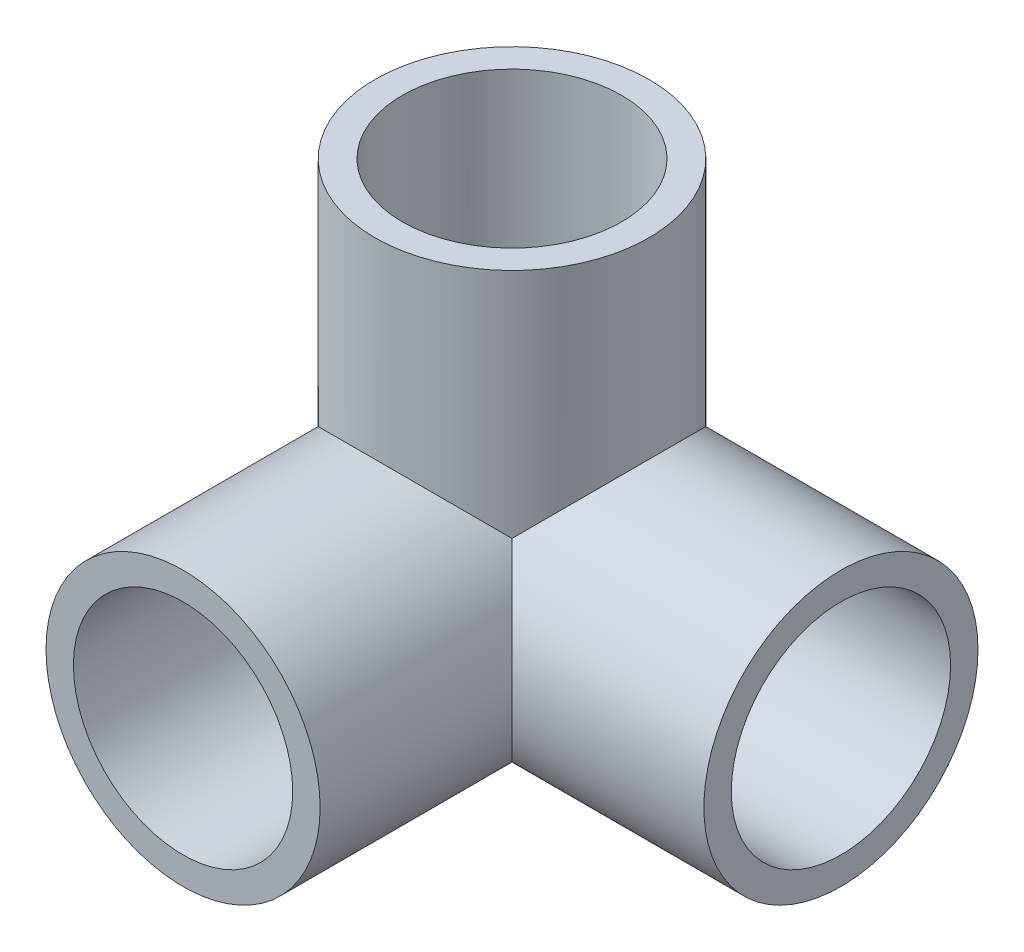
ISO-10303-21;
HEADER;
FILE_DESCRIPTION(('STEP AP214'),'2;1');
FILE_NAME('part.step','',(''),(''),'','','');
FILE_SCHEMA(('AUTOMOTIVE_DESIGN { 1 0 10303 214 1 1 1 1 }'));
ENDSEC;
DATA;
#1=APPLICATION_CONTEXT('core data for automotive mechanical design processes');
#2=APPLICATION_PROTOCOL_DEFINITION('international standard','automotive_design',2000,#1);
#3=PRODUCT_CONTEXT('',#1,'mechanical');
#4=PRODUCT('Part','Part','',(#3));
#5=PRODUCT_RELATED_PRODUCT_CATEGORY('part','',(#4));
#6=PRODUCT_DEFINITION_FORMATION('','',#4);
#7=PRODUCT_DEFINITION_CONTEXT('part definition',#1,'design');
#8=PRODUCT_DEFINITION('design','',#6,#7);
#9=PRODUCT_DEFINITION_SHAPE('','',#8);
#10=(LENGTH_UNIT() NAMED_UNIT(*) SI_UNIT(.MILLI.,.METRE.));
#11=(NAMED_UNIT(*) PLANE_ANGLE_UNIT() SI_UNIT($,.RADIAN.));
#12=(NAMED_UNIT(*) SI_UNIT($,.STERADIAN.) SOLID_ANGLE_UNIT());
#13=UNCERTAINTY_MEASURE_WITH_UNIT(LENGTH_MEASURE(1.E-05),#10,'distance_accuracy_value','');
#14=(GEOMETRIC_REPRESENTATION_CONTEXT(3) GLOBAL_UNCERTAINTY_ASSIGNED_CONTEXT((#13)) GLOBAL_UNIT_ASSIGNED_CONTEXT((#10,
#11,#12)) REPRESENTATION_CONTEXT('',''));
#15=CARTESIAN_POINT('',(0.,0.,0.));
#16=DIRECTION('',(0.,0.,1.));
#17=DIRECTION('',(1.,0.,0.));
#18=AXIS2_PLACEMENT_3D('',#15,#16,#17);
#19=CARTESIAN_POINT('',(0.,0.,38.1));
#20=DIRECTION('',(0.,0.,-1.));
#21=DIRECTION('',(-1.,0.,0.));
#22=AXIS2_PLACEMENT_3D('',#19,#20,#21);
#23=CYLINDRICAL_SURFACE('',#22,15.875);
#24=CARTESIAN_POINT('',(0.,0.,38.1));
#25=DIRECTION('',(0.,0.,1.));
#26=DIRECTION('',(1.,0.,0.));
#27=AXIS2_PLACEMENT_3D('',#24,#25,#26);
#28=CIRCLE('',#27,15.875);
#29=CARTESIAN_POINT('',(15.875,0.,38.1));
#30=VERTEX_POINT('',#29);
#31=EDGE_CURVE('E11',#30,#30,#28,.T.);
#32=ORIENTED_EDGE('',*,*,#31,.F.);
#33=EDGE_LOOP('',(#32));
#34=FACE_BOUND('',#33,.T.);
#35=CARTESIAN_POINT('',(0.,0.,0.));
#36=DIRECTION('',(0.707106781186547,0.,-0.707106781186547));
#37=DIRECTION('',(-0.707106781186547,0.,-0.707106781186547));
#38=AXIS2_PLACEMENT_3D('',#35,#36,#37);
#39=ELLIPSE('',#38,22.4506403026729,15.875);
#40=CARTESIAN_POINT('',(11.2253201513364,11.2253201513364,11.2253201513364));
#41=VERTEX_POINT('',#40);
#42=CARTESIAN_POINT('',(0.,-15.875,0.));
#43=VERTEX_POINT('',#42);
#44=EDGE_CURVE('E113',#41,#43,#39,.T.);
#45=ORIENTED_EDGE('',*,*,#44,.F.);
#46=CARTESIAN_POINT('',(0.,0.,0.));
#47=DIRECTION('',(0.,0.707106781186547,-0.707106781186547));
#48=DIRECTION('',(0.,-0.707106781186547,-0.707106781186547));
#49=AXIS2_PLACEMENT_3D('',#46,#47,#48);
#50=ELLIPSE('',#49,22.4506403026729,15.875);
#51=CARTESIAN_POINT('',(-15.875,0.,0.));
#52=VERTEX_POINT('',#51);
#53=EDGE_CURVE('E51',#52,#41,#50,.T.);
#54=ORIENTED_EDGE('',*,*,#53,.F.);
#55=CARTESIAN_POINT('',(0.,0.,0.));
#56=DIRECTION('',(0.,0.,1.));
#57=DIRECTION('',(1.,0.,0.));
#58=AXIS2_PLACEMENT_3D('',#55,#56,#57);
#59=CIRCLE('',#58,15.875);
#60=EDGE_CURVE('E40',#52,#43,#59,.T.);
#61=ORIENTED_EDGE('',*,*,#60,.T.);
#62=EDGE_LOOP('',(#45,#54,#61));
#63=FACE_BOUND('',#62,.T.);
#64=ADVANCED_FACE('F37',(#34,#63),#23,.T.);
#65=CARTESIAN_POINT('',(0.,38.1,0.));
#66=DIRECTION('',(0.,-1.,0.));
#67=DIRECTION('',(0.,0.,-1.));
#68=AXIS2_PLACEMENT_3D('',#65,#66,#67);
#69=CYLINDRICAL_SURFACE('',#68,15.875);
#70=CARTESIAN_POINT('',(0.,38.1,0.));
#71=DIRECTION('',(0.,1.,0.));
#72=DIRECTION('',(0.,0.,1.));
#73=AXIS2_PLACEMENT_3D('',#70,#71,#72);
#74=CIRCLE('',#73,15.875);
#75=CARTESIAN_POINT('',(0.,38.1,15.875));
#76=VERTEX_POINT('',#75);
#77=EDGE_CURVE('E94',#76,#76,#74,.T.);
#78=ORIENTED_EDGE('',*,*,#77,.F.);
#79=EDGE_LOOP('',(#78));
#80=FACE_BOUND('',#79,.T.);
#81=CARTESIAN_POINT('',(0.,0.,0.));
#82=DIRECTION('',(0.707106781186547,-0.707106781186547,0.));
#83=DIRECTION('',(-0.707106781186547,-0.707106781186547,0.));
#84=AXIS2_PLACEMENT_3D('',#81,#82,#83);
#85=ELLIPSE('',#84,22.4506403026729,15.875);
#86=CARTESIAN_POINT('',(0.,0.,-15.875));
#87=VERTEX_POINT('',#86);
#88=EDGE_CURVE('E108',#87,#41,#85,.T.);
#89=ORIENTED_EDGE('',*,*,#88,.F.);
#90=CARTESIAN_POINT('',(0.,0.,0.));
#91=DIRECTION('',(0.,1.,0.));
#92=DIRECTION('',(0.,0.,1.));
#93=AXIS2_PLACEMENT_3D('',#90,#91,#92);
#94=CIRCLE('',#93,15.875);
#95=EDGE_CURVE('E58',#87,#52,#94,.T.);
#96=ORIENTED_EDGE('',*,*,#95,.T.);
#97=ORIENTED_EDGE('',*,*,#53,.T.);
#98=EDGE_LOOP('',(#89,#96,#97));
#99=FACE_BOUND('',#98,.T.);
#100=ADVANCED_FACE('F132',(#80,#99),#69,.T.);
#101=CARTESIAN_POINT('',(0.,0.,38.1));
#102=DIRECTION('',(0.,0.,1.));
#103=DIRECTION('',(1.,0.,0.));
#104=AXIS2_PLACEMENT_3D('',#101,#102,#103);
#105=PLANE('',#104);
#106=ORIENTED_EDGE('',*,*,#31,.T.);
#107=EDGE_LOOP('',(#106));
#108=FACE_BOUND('',#107,.T.);
#109=CARTESIAN_POINT('',(0.,0.,38.1));
#110=DIRECTION('',(0.,0.,1.));
#111=DIRECTION('',(1.,0.,0.));
#112=AXIS2_PLACEMENT_3D('',#109,#110,#111);
#113=CIRCLE('',#112,12.7);
#114=CARTESIAN_POINT('',(12.7,0.,38.1));
#115=VERTEX_POINT('',#114);
#116=EDGE_CURVE('E123',#115,#115,#113,.T.);
#117=ORIENTED_EDGE('',*,*,#116,.F.);
#118=EDGE_LOOP('',(#117));
#119=FACE_BOUND('',#118,.T.);
#120=ADVANCED_FACE('F134',(#108,#119),#105,.T.);
#121=CARTESIAN_POINT('',(0.,38.1,0.));
#122=DIRECTION('',(0.,1.,0.));
#123=DIRECTION('',(0.,0.,1.));
#124=AXIS2_PLACEMENT_3D('',#121,#122,#123);
#125=PLANE('',#124);
#126=ORIENTED_EDGE('',*,*,#77,.T.);
#127=EDGE_LOOP('',(#126));
#128=FACE_BOUND('',#127,.T.);
#129=CARTESIAN_POINT('',(0.,38.1,0.));
#130=DIRECTION('',(0.,1.,0.));
#131=DIRECTION('',(0.,0.,1.));
#132=AXIS2_PLACEMENT_3D('',#129,#130,#131);
#133=CIRCLE('',#132,12.7);
#134=CARTESIAN_POINT('',(0.,38.1,12.7));
#135=VERTEX_POINT('',#134);
#136=EDGE_CURVE('E118',#135,#135,#133,.T.);
#137=ORIENTED_EDGE('',*,*,#136,.F.);
#138=EDGE_LOOP('',(#137));
#139=FACE_BOUND('',#138,.T.);
#140=ADVANCED_FACE('F141',(#128,#139),#125,.T.);
#141=CARTESIAN_POINT('',(38.1,0.,0.));
#142=DIRECTION('',(1.,0.,0.));
#143=DIRECTION('',(0.,0.,-1.));
#144=AXIS2_PLACEMENT_3D('',#141,#142,#143);
#145=PLANE('',#144);
#146=CARTESIAN_POINT('',(38.1,0.,0.));
#147=DIRECTION('',(1.,0.,0.));
#148=DIRECTION('',(0.,0.,-1.));
#149=AXIS2_PLACEMENT_3D('',#146,#147,#148);
#150=CIRCLE('',#149,15.875);
#151=CARTESIAN_POINT('',(38.1,0.,-15.875));
#152=VERTEX_POINT('',#151);
#153=EDGE_CURVE('E105',#152,#152,#150,.T.);
#154=ORIENTED_EDGE('',*,*,#153,.T.);
#155=EDGE_LOOP('',(#154));
#156=FACE_BOUND('',#155,.T.);
#157=CARTESIAN_POINT('',(38.1,0.,0.));
#158=DIRECTION('',(1.,0.,0.));
#159=DIRECTION('',(0.,0.,-1.));
#160=AXIS2_PLACEMENT_3D('',#157,#158,#159);
#161=CIRCLE('',#160,12.7);
#162=CARTESIAN_POINT('',(38.1,0.,-12.7));
#163=VERTEX_POINT('',#162);
#164=EDGE_CURVE('E98',#163,#163,#161,.T.);
#165=ORIENTED_EDGE('',*,*,#164,.F.);
#166=EDGE_LOOP('',(#165));
#167=FACE_BOUND('',#166,.T.);
#168=ADVANCED_FACE('F166',(#156,#167),#145,.T.);
#169=CARTESIAN_POINT('',(38.1,0.,0.));
#170=DIRECTION('',(-1.,0.,0.));
#171=DIRECTION('',(0.,0.,1.));
#172=AXIS2_PLACEMENT_3D('',#169,#170,#171);
#173=CYLINDRICAL_SURFACE('',#172,12.7);
#174=ORIENTED_EDGE('',*,*,#164,.T.);
#175=EDGE_LOOP('',(#174));
#176=FACE_BOUND('',#175,.T.);
#177=CARTESIAN_POINT('',(0.,0.,0.));
#178=DIRECTION('',(1.,0.,0.));
#179=DIRECTION('',(0.,0.,-1.));
#180=AXIS2_PLACEMENT_3D('',#177,#178,#179);
#181=CIRCLE('',#180,12.7);
#182=CARTESIAN_POINT('',(0.,-12.7,0.));
#183=VERTEX_POINT('',#182);
#184=CARTESIAN_POINT('',(0.,0.,-12.7));
#185=VERTEX_POINT('',#184);
#186=EDGE_CURVE('E81',#183,#185,#181,.T.);
#187=ORIENTED_EDGE('',*,*,#186,.F.);
#188=CARTESIAN_POINT('',(0.,0.,0.));
#189=DIRECTION('',(0.707106781186547,0.,-0.707106781186547));
#190=DIRECTION('',(-0.707106781186547,0.,-0.707106781186547));
#191=AXIS2_PLACEMENT_3D('',#188,#189,#190);
#192=ELLIPSE('',#191,17.9605122421383,12.7);
#193=CARTESIAN_POINT('',(8.98025612106915,8.98025612106915,8.98025612106915));
#194=VERTEX_POINT('',#193);
#195=EDGE_CURVE('E83',#183,#194,#192,.F.);
#196=ORIENTED_EDGE('',*,*,#195,.T.);
#197=CARTESIAN_POINT('',(0.,0.,0.));
#198=DIRECTION('',(0.707106781186547,-0.707106781186547,0.));
#199=DIRECTION('',(-0.707106781186547,-0.707106781186547,0.));
#200=AXIS2_PLACEMENT_3D('',#197,#198,#199);
#201=ELLIPSE('',#200,17.9605122421383,12.7);
#202=EDGE_CURVE('E77',#194,#185,#201,.F.);
#203=ORIENTED_EDGE('',*,*,#202,.T.);
#204=EDGE_LOOP('',(#187,#196,#203));
#205=FACE_BOUND('',#204,.T.);
#206=ADVANCED_FACE('F79',(#176,#205),#173,.F.);
#207=CARTESIAN_POINT('',(38.1,0.,0.));
#208=DIRECTION('',(-1.,0.,0.));
#209=DIRECTION('',(0.,0.,1.));
#210=AXIS2_PLACEMENT_3D('',#207,#208,#209);
#211=CYLINDRICAL_SURFACE('',#210,15.875);
#212=ORIENTED_EDGE('',*,*,#153,.F.);
#213=EDGE_LOOP('',(#212));
#214=FACE_BOUND('',#213,.T.);
#215=ORIENTED_EDGE('',*,*,#88,.T.);
#216=ORIENTED_EDGE('',*,*,#44,.T.);
#217=CARTESIAN_POINT('',(0.,0.,0.));
#218=DIRECTION('',(1.,0.,0.));
#219=DIRECTION('',(0.,0.,-1.));
#220=AXIS2_PLACEMENT_3D('',#217,#218,#219);
#221=CIRCLE('',#220,15.875);
#222=EDGE_CURVE('E101',#43,#87,#221,.T.);
#223=ORIENTED_EDGE('',*,*,#222,.T.);
#224=EDGE_LOOP('',(#215,#216,#223));
#225=FACE_BOUND('',#224,.T.);
#226=ADVANCED_FACE('F131',(#214,#225),#211,.T.);
#227=CARTESIAN_POINT('',(0.,38.1,0.));
#228=DIRECTION('',(0.,-1.,0.));
#229=DIRECTION('',(0.,0.,-1.));
#230=AXIS2_PLACEMENT_3D('',#227,#228,#229);
#231=CYLINDRICAL_SURFACE('',#230,12.7);
#232=ORIENTED_EDGE('',*,*,#202,.F.);
#233=CARTESIAN_POINT('',(0.,0.,0.));
#234=DIRECTION('',(0.,-0.707106781186547,0.707106781186547));
#235=DIRECTION('',(0.,-0.707106781186547,-0.707106781186547));
#236=AXIS2_PLACEMENT_3D('',#233,#234,#235);
#237=ELLIPSE('',#236,17.9605122421383,12.7);
#238=CARTESIAN_POINT('',(-12.7,0.,0.));
#239=VERTEX_POINT('',#238);
#240=EDGE_CURVE('E86',#239,#194,#237,.F.);
#241=ORIENTED_EDGE('',*,*,#240,.F.);
#242=CARTESIAN_POINT('',(0.,0.,0.));
#243=DIRECTION('',(0.,1.,0.));
#244=DIRECTION('',(0.,0.,1.));
#245=AXIS2_PLACEMENT_3D('',#242,#243,#244);
#246=CIRCLE('',#245,12.7);
#247=EDGE_CURVE('E89',#185,#239,#246,.T.);
#248=ORIENTED_EDGE('',*,*,#247,.F.);
#249=EDGE_LOOP('',(#232,#241,#248));
#250=FACE_BOUND('',#249,.T.);
#251=ORIENTED_EDGE('',*,*,#136,.T.);
#252=EDGE_LOOP('',(#251));
#253=FACE_BOUND('',#252,.T.);
#254=ADVANCED_FACE('F90',(#250,#253),#231,.F.);
#255=CARTESIAN_POINT('',(0.,0.,38.1));
#256=DIRECTION('',(0.,0.,-1.));
#257=DIRECTION('',(-1.,0.,0.));
#258=AXIS2_PLACEMENT_3D('',#255,#256,#257);
#259=CYLINDRICAL_SURFACE('',#258,12.7);
#260=ORIENTED_EDGE('',*,*,#195,.F.);
#261=CARTESIAN_POINT('',(0.,0.,0.));
#262=DIRECTION('',(0.,0.,1.));
#263=DIRECTION('',(1.,0.,0.));
#264=AXIS2_PLACEMENT_3D('',#261,#262,#263);
#265=CIRCLE('',#264,12.7);
#266=EDGE_CURVE('E97',#239,#183,#265,.T.);
#267=ORIENTED_EDGE('',*,*,#266,.F.);
#268=ORIENTED_EDGE('',*,*,#240,.T.);
#269=EDGE_LOOP('',(#260,#267,#268));
#270=FACE_BOUND('',#269,.T.);
#271=ORIENTED_EDGE('',*,*,#116,.T.);
#272=EDGE_LOOP('',(#271));
#273=FACE_BOUND('',#272,.T.);
#274=ADVANCED_FACE('F148',(#270,#273),#259,.F.);
#275=CARTESIAN_POINT('',(0.,0.,0.));
#276=DIRECTION('',(0.,0.,1.));
#277=DIRECTION('',(-1.,0.,0.));
#278=AXIS2_PLACEMENT_3D('',#275,#276,#277);
#279=SPHERICAL_SURFACE('',#278,12.7);
#280=ORIENTED_EDGE('',*,*,#247,.T.);
#281=ORIENTED_EDGE('',*,*,#266,.T.);
#282=ORIENTED_EDGE('',*,*,#186,.T.);
#283=EDGE_LOOP('',(#280,#281,#282));
#284=FACE_BOUND('',#283,.T.);
#285=ADVANCED_FACE('F96',(#284),#279,.F.);
#286=CARTESIAN_POINT('',(0.,0.,0.));
#287=DIRECTION('',(0.,0.,1.));
#288=DIRECTION('',(-1.,0.,0.));
#289=AXIS2_PLACEMENT_3D('',#286,#287,#288);
#290=SPHERICAL_SURFACE('',#289,15.875);
#291=ORIENTED_EDGE('',*,*,#60,.F.);
#292=ORIENTED_EDGE('',*,*,#95,.F.);
#293=ORIENTED_EDGE('',*,*,#222,.F.);
#294=EDGE_LOOP('',(#291,#292,#293));
#295=FACE_BOUND('',#294,.T.);
#296=ADVANCED_FACE('F155',(#295),#290,.T.);
#297=CLOSED_SHELL('',(#64,#100,#120,#140,#168,#206,#226,#254,#274,#285,#296));
#298=MANIFOLD_SOLID_BREP('B2',#297);
#299=ADVANCED_BREP_SHAPE_REPRESENTATION('',(#18,#298),#14);
#300=SHAPE_DEFINITION_REPRESENTATION(#9,#299);
ENDSEC;
END-ISO-10303-21;
